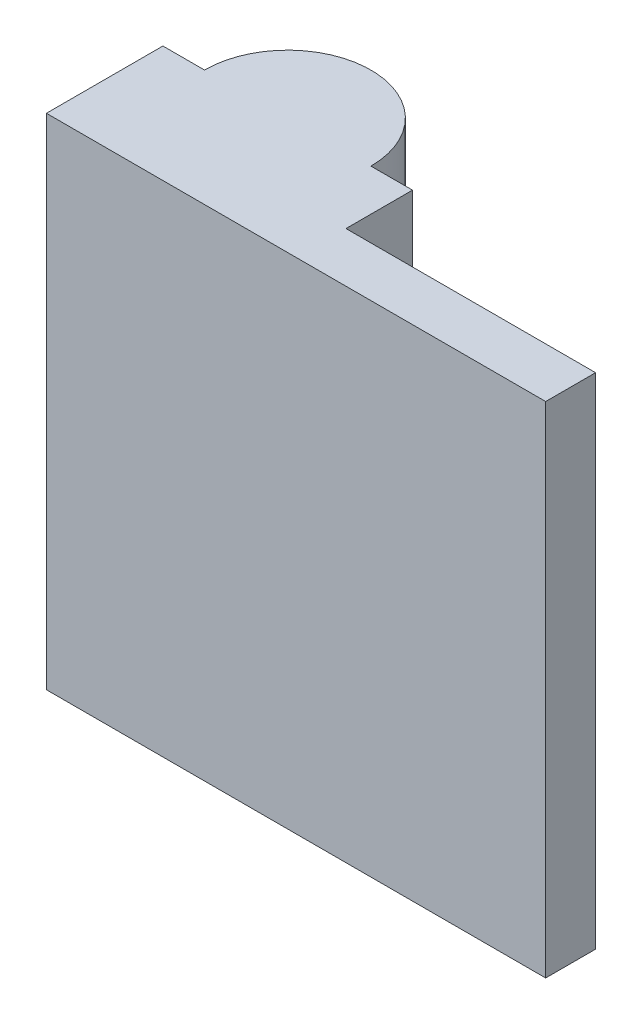
ISO-10303-21;
HEADER;
FILE_DESCRIPTION(('STEP AP214'),'2;1');
FILE_NAME('part.step','',(''),(''),'','','');
FILE_SCHEMA(('AUTOMOTIVE_DESIGN { 1 0 10303 214 1 1 1 1 }'));
ENDSEC;
DATA;
#1=APPLICATION_CONTEXT('core data for automotive mechanical design processes');
#2=APPLICATION_PROTOCOL_DEFINITION('international standard','automotive_design',2000,#1);
#3=PRODUCT_CONTEXT('',#1,'mechanical');
#4=PRODUCT('Part','Part','',(#3));
#5=PRODUCT_RELATED_PRODUCT_CATEGORY('part','',(#4));
#6=PRODUCT_DEFINITION_FORMATION('','',#4);
#7=PRODUCT_DEFINITION_CONTEXT('part definition',#1,'design');
#8=PRODUCT_DEFINITION('design','',#6,#7);
#9=PRODUCT_DEFINITION_SHAPE('','',#8);
#10=(LENGTH_UNIT() NAMED_UNIT(*) SI_UNIT(.MILLI.,.METRE.));
#11=(NAMED_UNIT(*) PLANE_ANGLE_UNIT() SI_UNIT($,.RADIAN.));
#12=(NAMED_UNIT(*) SI_UNIT($,.STERADIAN.) SOLID_ANGLE_UNIT());
#13=UNCERTAINTY_MEASURE_WITH_UNIT(LENGTH_MEASURE(1.E-05),#10,'distance_accuracy_value','');
#14=(GEOMETRIC_REPRESENTATION_CONTEXT(3) GLOBAL_UNCERTAINTY_ASSIGNED_CONTEXT((#13)) GLOBAL_UNIT_ASSIGNED_CONTEXT((#10,
#11,#12)) REPRESENTATION_CONTEXT('',''));
#15=CARTESIAN_POINT('',(0.,0.,0.));
#16=DIRECTION('',(0.,0.,1.));
#17=DIRECTION('',(1.,0.,0.));
#18=AXIS2_PLACEMENT_3D('',#15,#16,#17);
#19=CARTESIAN_POINT('',(7.5,30.,0.));
#20=DIRECTION('',(0.,-1.,0.));
#21=DIRECTION('',(0.,0.,-1.));
#22=AXIS2_PLACEMENT_3D('',#19,#20,#21);
#23=CYLINDRICAL_SURFACE('',#22,3.5);
#24=CARTESIAN_POINT('',(7.5,0.,0.));
#25=DIRECTION('',(0.,-1.,0.));
#26=DIRECTION('',(0.,0.,-1.));
#27=AXIS2_PLACEMENT_3D('',#24,#25,#26);
#28=CIRCLE('',#27,3.5);
#29=CARTESIAN_POINT('',(7.5,0.,-3.5));
#30=VERTEX_POINT('',#29);
#31=EDGE_CURVE('E177',#30,#30,#28,.T.);
#32=ORIENTED_EDGE('',*,*,#31,.T.);
#33=EDGE_LOOP('',(#32));
#34=FACE_BOUND('',#33,.T.);
#35=CARTESIAN_POINT('',(7.5,20.,0.));
#36=DIRECTION('',(0.,1.,0.));
#37=DIRECTION('',(0.,0.,1.));
#38=AXIS2_PLACEMENT_3D('',#35,#36,#37);
#39=CIRCLE('',#38,3.5);
#40=CARTESIAN_POINT('',(7.5,20.,3.5));
#41=VERTEX_POINT('',#40);
#42=EDGE_CURVE('E13',#41,#41,#39,.F.);
#43=ORIENTED_EDGE('',*,*,#42,.F.);
#44=EDGE_LOOP('',(#43));
#45=FACE_BOUND('',#44,.T.);
#46=ADVANCED_FACE('F47',(#34,#45),#23,.F.);
#47=CARTESIAN_POINT('',(0.,0.,0.));
#48=DIRECTION('',(0.,0.,-1.));
#49=DIRECTION('',(-1.,0.,0.));
#50=AXIS2_PLACEMENT_3D('',#47,#48,#49);
#51=PLANE('',#50);
#52=DIRECTION('',(0.,-1.,0.));
#53=VECTOR('',#52,1.);
#54=CARTESIAN_POINT('',(12.5,40.,0.));
#55=LINE('',#54,#53);
#56=CARTESIAN_POINT('',(12.5,30.,0.));
#57=VERTEX_POINT('',#56);
#58=CARTESIAN_POINT('',(12.5,0.,0.));
#59=VERTEX_POINT('',#58);
#60=EDGE_CURVE('E55',#57,#59,#55,.T.);
#61=ORIENTED_EDGE('',*,*,#60,.F.);
#62=DIRECTION('',(-1.,0.,0.));
#63=VECTOR('',#62,1.);
#64=CARTESIAN_POINT('',(0.,30.,0.));
#65=LINE('',#64,#63);
#66=CARTESIAN_POINT('',(15.,30.,0.));
#67=VERTEX_POINT('',#66);
#68=EDGE_CURVE('E126',#67,#57,#65,.T.);
#69=ORIENTED_EDGE('',*,*,#68,.F.);
#70=DIRECTION('',(0.,1.,0.));
#71=VECTOR('',#70,1.);
#72=CARTESIAN_POINT('',(15.,0.,0.));
#73=LINE('',#72,#71);
#74=CARTESIAN_POINT('',(15.,0.,0.));
#75=VERTEX_POINT('',#74);
#76=EDGE_CURVE('E165',#75,#67,#73,.T.);
#77=ORIENTED_EDGE('',*,*,#76,.F.);
#78=DIRECTION('',(1.,0.,0.));
#79=VECTOR('',#78,1.);
#80=CARTESIAN_POINT('',(0.,0.,0.));
#81=LINE('',#80,#79);
#82=EDGE_CURVE('E67',#59,#75,#81,.T.);
#83=ORIENTED_EDGE('',*,*,#82,.F.);
#84=EDGE_LOOP('',(#61,#69,#77,#83));
#85=FACE_BOUND('',#84,.T.);
#86=ADVANCED_FACE('F124',(#85),#51,.T.);
#87=CARTESIAN_POINT('',(0.,0.,10.));
#88=DIRECTION('',(1.,0.,0.));
#89=DIRECTION('',(0.,0.,-1.));
#90=AXIS2_PLACEMENT_3D('',#87,#88,#89);
#91=PLANE('',#90);
#92=DIRECTION('',(0.,0.,-1.));
#93=VECTOR('',#92,1.);
#94=CARTESIAN_POINT('',(0.,0.,10.));
#95=LINE('',#94,#93);
#96=CARTESIAN_POINT('',(0.,0.,7.));
#97=VERTEX_POINT('',#96);
#98=CARTESIAN_POINT('',(0.,0.,0.));
#99=VERTEX_POINT('',#98);
#100=EDGE_CURVE('E144',#97,#99,#95,.T.);
#101=ORIENTED_EDGE('',*,*,#100,.F.);
#102=DIRECTION('',(0.,-1.,0.));
#103=VECTOR('',#102,1.);
#104=CARTESIAN_POINT('',(0.,0.,7.));
#105=LINE('',#104,#103);
#106=CARTESIAN_POINT('',(0.,30.,7.));
#107=VERTEX_POINT('',#106);
#108=EDGE_CURVE('E120',#107,#97,#105,.T.);
#109=ORIENTED_EDGE('',*,*,#108,.F.);
#110=DIRECTION('',(0.,0.,-1.));
#111=VECTOR('',#110,1.);
#112=CARTESIAN_POINT('',(0.,30.,10.));
#113=LINE('',#112,#111);
#114=CARTESIAN_POINT('',(0.,30.,0.));
#115=VERTEX_POINT('',#114);
#116=EDGE_CURVE('E132',#107,#115,#113,.T.);
#117=ORIENTED_EDGE('',*,*,#116,.T.);
#118=DIRECTION('',(0.,-1.,0.));
#119=VECTOR('',#118,1.);
#120=CARTESIAN_POINT('',(0.,0.,0.));
#121=LINE('',#120,#119);
#122=EDGE_CURVE('E158',#115,#99,#121,.T.);
#123=ORIENTED_EDGE('',*,*,#122,.T.);
#124=EDGE_LOOP('',(#101,#109,#117,#123));
#125=FACE_BOUND('',#124,.T.);
#126=ADVANCED_FACE('F49',(#125),#91,.F.);
#127=CARTESIAN_POINT('',(0.,0.,10.));
#128=DIRECTION('',(0.,1.,0.));
#129=DIRECTION('',(0.,0.,1.));
#130=AXIS2_PLACEMENT_3D('',#127,#128,#129);
#131=PLANE('',#130);
#132=ORIENTED_EDGE('',*,*,#31,.F.);
#133=EDGE_LOOP('',(#132));
#134=FACE_BOUND('',#133,.T.);
#135=DIRECTION('',(0.,0.,-1.));
#136=VECTOR('',#135,1.);
#137=CARTESIAN_POINT('',(15.,0.,4.));
#138=LINE('',#137,#136);
#139=CARTESIAN_POINT('',(15.,0.,4.));
#140=VERTEX_POINT('',#139);
#141=EDGE_CURVE('E160',#140,#75,#138,.T.);
#142=ORIENTED_EDGE('',*,*,#141,.F.);
#143=DIRECTION('',(-1.,0.,0.));
#144=VECTOR('',#143,1.);
#145=CARTESIAN_POINT('',(30.,0.,4.));
#146=LINE('',#145,#144);
#147=CARTESIAN_POINT('',(30.,0.,4.));
#148=VERTEX_POINT('',#147);
#149=EDGE_CURVE('E172',#148,#140,#146,.T.);
#150=ORIENTED_EDGE('',*,*,#149,.F.);
#151=DIRECTION('',(0.,0.,-1.));
#152=VECTOR('',#151,1.);
#153=CARTESIAN_POINT('',(30.,0.,10.));
#154=LINE('',#153,#152);
#155=CARTESIAN_POINT('',(30.,0.,7.));
#156=VERTEX_POINT('',#155);
#157=EDGE_CURVE('E142',#156,#148,#154,.T.);
#158=ORIENTED_EDGE('',*,*,#157,.F.);
#159=DIRECTION('',(-1.,0.,0.));
#160=VECTOR('',#159,1.);
#161=CARTESIAN_POINT('',(30.,0.,7.));
#162=LINE('',#161,#160);
#163=EDGE_CURVE('E150',#156,#97,#162,.T.);
#164=ORIENTED_EDGE('',*,*,#163,.T.);
#165=ORIENTED_EDGE('',*,*,#100,.T.);
#166=CARTESIAN_POINT('',(2.5,0.,0.));
#167=VERTEX_POINT('',#166);
#168=EDGE_CURVE('E137',#99,#167,#81,.T.);
#169=ORIENTED_EDGE('',*,*,#168,.T.);
#170=CARTESIAN_POINT('',(7.5,0.,0.));
#171=DIRECTION('',(0.,-1.,0.));
#172=DIRECTION('',(0.,0.,-1.));
#173=AXIS2_PLACEMENT_3D('',#170,#171,#172);
#174=CIRCLE('',#173,5.);
#175=EDGE_CURVE('E62',#167,#59,#174,.T.);
#176=ORIENTED_EDGE('',*,*,#175,.T.);
#177=ORIENTED_EDGE('',*,*,#82,.T.);
#178=EDGE_LOOP('',(#142,#150,#158,#164,#165,#169,#176,#177));
#179=FACE_BOUND('',#178,.T.);
#180=ADVANCED_FACE('F148',(#134,#179),#131,.F.);
#181=CARTESIAN_POINT('',(30.,0.,10.));
#182=DIRECTION('',(-1.,0.,0.));
#183=DIRECTION('',(0.,0.,1.));
#184=AXIS2_PLACEMENT_3D('',#181,#182,#183);
#185=PLANE('',#184);
#186=DIRECTION('',(0.,0.,-1.));
#187=VECTOR('',#186,1.);
#188=CARTESIAN_POINT('',(30.,30.,10.));
#189=LINE('',#188,#187);
#190=CARTESIAN_POINT('',(30.,30.,7.));
#191=VERTEX_POINT('',#190);
#192=CARTESIAN_POINT('',(30.,30.,4.));
#193=VERTEX_POINT('',#192);
#194=EDGE_CURVE('E135',#191,#193,#189,.T.);
#195=ORIENTED_EDGE('',*,*,#194,.F.);
#196=DIRECTION('',(0.,-1.,0.));
#197=VECTOR('',#196,1.);
#198=CARTESIAN_POINT('',(30.,0.,7.));
#199=LINE('',#198,#197);
#200=EDGE_CURVE('E182',#191,#156,#199,.T.);
#201=ORIENTED_EDGE('',*,*,#200,.T.);
#202=ORIENTED_EDGE('',*,*,#157,.T.);
#203=DIRECTION('',(0.,-1.,0.));
#204=VECTOR('',#203,1.);
#205=CARTESIAN_POINT('',(30.,0.,4.));
#206=LINE('',#205,#204);
#207=EDGE_CURVE('E167',#193,#148,#206,.T.);
#208=ORIENTED_EDGE('',*,*,#207,.F.);
#209=EDGE_LOOP('',(#195,#201,#202,#208));
#210=FACE_BOUND('',#209,.T.);
#211=ADVANCED_FACE('F188',(#210),#185,.F.);
#212=CARTESIAN_POINT('',(0.,30.,10.));
#213=DIRECTION('',(0.,-1.,0.));
#214=DIRECTION('',(0.,0.,-1.));
#215=AXIS2_PLACEMENT_3D('',#212,#213,#214);
#216=PLANE('',#215);
#217=ORIENTED_EDGE('',*,*,#194,.T.);
#218=DIRECTION('',(1.,0.,0.));
#219=VECTOR('',#218,1.);
#220=CARTESIAN_POINT('',(30.,30.,4.));
#221=LINE('',#220,#219);
#222=CARTESIAN_POINT('',(15.,30.,4.));
#223=VERTEX_POINT('',#222);
#224=EDGE_CURVE('E163',#223,#193,#221,.T.);
#225=ORIENTED_EDGE('',*,*,#224,.F.);
#226=DIRECTION('',(0.,0.,-1.));
#227=VECTOR('',#226,1.);
#228=CARTESIAN_POINT('',(15.,30.,4.));
#229=LINE('',#228,#227);
#230=EDGE_CURVE('E131',#223,#67,#229,.T.);
#231=ORIENTED_EDGE('',*,*,#230,.T.);
#232=ORIENTED_EDGE('',*,*,#68,.T.);
#233=CARTESIAN_POINT('',(7.5,30.,0.));
#234=DIRECTION('',(0.,-1.,0.));
#235=DIRECTION('',(1.,0.,0.));
#236=AXIS2_PLACEMENT_3D('',#233,#234,#235);
#237=CIRCLE('',#236,5.);
#238=CARTESIAN_POINT('',(2.5,30.,0.));
#239=VERTEX_POINT('',#238);
#240=EDGE_CURVE('E111',#57,#239,#237,.F.);
#241=ORIENTED_EDGE('',*,*,#240,.T.);
#242=EDGE_CURVE('E133',#239,#115,#65,.T.);
#243=ORIENTED_EDGE('',*,*,#242,.T.);
#244=ORIENTED_EDGE('',*,*,#116,.F.);
#245=DIRECTION('',(-1.,0.,0.));
#246=VECTOR('',#245,1.);
#247=CARTESIAN_POINT('',(30.,30.,7.));
#248=LINE('',#247,#246);
#249=EDGE_CURVE('E180',#191,#107,#248,.T.);
#250=ORIENTED_EDGE('',*,*,#249,.F.);
#251=EDGE_LOOP('',(#217,#225,#231,#232,#241,#243,#244,#250));
#252=FACE_BOUND('',#251,.T.);
#253=ADVANCED_FACE('F129',(#252),#216,.F.);
#254=DIRECTION('',(0.,-1.,0.));
#255=VECTOR('',#254,1.);
#256=CARTESIAN_POINT('',(2.5,40.,0.));
#257=LINE('',#256,#255);
#258=EDGE_CURVE('E115',#167,#239,#257,.F.);
#259=ORIENTED_EDGE('',*,*,#258,.F.);
#260=ORIENTED_EDGE('',*,*,#168,.F.);
#261=ORIENTED_EDGE('',*,*,#122,.F.);
#262=ORIENTED_EDGE('',*,*,#242,.F.);
#263=EDGE_LOOP('',(#259,#260,#261,#262));
#264=FACE_BOUND('',#263,.T.);
#265=ADVANCED_FACE('F157',(#264),#51,.T.);
#266=CARTESIAN_POINT('',(15.,0.,4.));
#267=DIRECTION('',(-1.,0.,0.));
#268=DIRECTION('',(0.,0.,1.));
#269=AXIS2_PLACEMENT_3D('',#266,#267,#268);
#270=PLANE('',#269);
#271=ORIENTED_EDGE('',*,*,#76,.T.);
#272=ORIENTED_EDGE('',*,*,#230,.F.);
#273=DIRECTION('',(0.,1.,0.));
#274=VECTOR('',#273,1.);
#275=CARTESIAN_POINT('',(15.,0.,4.));
#276=LINE('',#275,#274);
#277=EDGE_CURVE('E169',#140,#223,#276,.T.);
#278=ORIENTED_EDGE('',*,*,#277,.F.);
#279=ORIENTED_EDGE('',*,*,#141,.T.);
#280=EDGE_LOOP('',(#271,#272,#278,#279));
#281=FACE_BOUND('',#280,.T.);
#282=ADVANCED_FACE('F197',(#281),#270,.F.);
#283=CARTESIAN_POINT('',(0.,0.,4.));
#284=DIRECTION('',(0.,0.,1.));
#285=DIRECTION('',(1.,0.,0.));
#286=AXIS2_PLACEMENT_3D('',#283,#284,#285);
#287=PLANE('',#286);
#288=ORIENTED_EDGE('',*,*,#224,.T.);
#289=ORIENTED_EDGE('',*,*,#207,.T.);
#290=ORIENTED_EDGE('',*,*,#149,.T.);
#291=ORIENTED_EDGE('',*,*,#277,.T.);
#292=EDGE_LOOP('',(#288,#289,#290,#291));
#293=FACE_BOUND('',#292,.T.);
#294=ADVANCED_FACE('F195',(#293),#287,.F.);
#295=CARTESIAN_POINT('',(7.5,40.,0.));
#296=DIRECTION('',(0.,-1.,0.));
#297=DIRECTION('',(0.,0.,-1.));
#298=AXIS2_PLACEMENT_3D('',#295,#296,#297);
#299=CYLINDRICAL_SURFACE('',#298,5.);
#300=ORIENTED_EDGE('',*,*,#258,.T.);
#301=ORIENTED_EDGE('',*,*,#240,.F.);
#302=ORIENTED_EDGE('',*,*,#60,.T.);
#303=ORIENTED_EDGE('',*,*,#175,.F.);
#304=EDGE_LOOP('',(#300,#301,#302,#303));
#305=FACE_BOUND('',#304,.T.);
#306=ADVANCED_FACE('F113',(#305),#299,.T.);
#307=CARTESIAN_POINT('',(30.,0.,7.));
#308=DIRECTION('',(0.,0.,-1.));
#309=DIRECTION('',(-1.,0.,0.));
#310=AXIS2_PLACEMENT_3D('',#307,#308,#309);
#311=PLANE('',#310);
#312=ORIENTED_EDGE('',*,*,#163,.F.);
#313=ORIENTED_EDGE('',*,*,#200,.F.);
#314=ORIENTED_EDGE('',*,*,#249,.T.);
#315=ORIENTED_EDGE('',*,*,#108,.T.);
#316=EDGE_LOOP('',(#312,#313,#314,#315));
#317=FACE_BOUND('',#316,.T.);
#318=ADVANCED_FACE('F215',(#317),#311,.F.);
#319=CARTESIAN_POINT('',(7.5,20.,0.));
#320=DIRECTION('',(0.,1.,0.));
#321=DIRECTION('',(0.,0.,1.));
#322=AXIS2_PLACEMENT_3D('',#319,#320,#321);
#323=PLANE('',#322);
#324=ORIENTED_EDGE('',*,*,#42,.T.);
#325=EDGE_LOOP('',(#324));
#326=FACE_BOUND('',#325,.T.);
#327=ADVANCED_FACE('F221',(#326),#323,.F.);
#328=CLOSED_SHELL('',(#46,#86,#126,#180,#211,#253,#265,#282,#294,#306,#318,#327));
#329=MANIFOLD_SOLID_BREP('B2',#328);
#330=ADVANCED_BREP_SHAPE_REPRESENTATION('',(#18,#329),#14);
#331=SHAPE_DEFINITION_REPRESENTATION(#9,#330);
ENDSEC;
END-ISO-10303-21;
